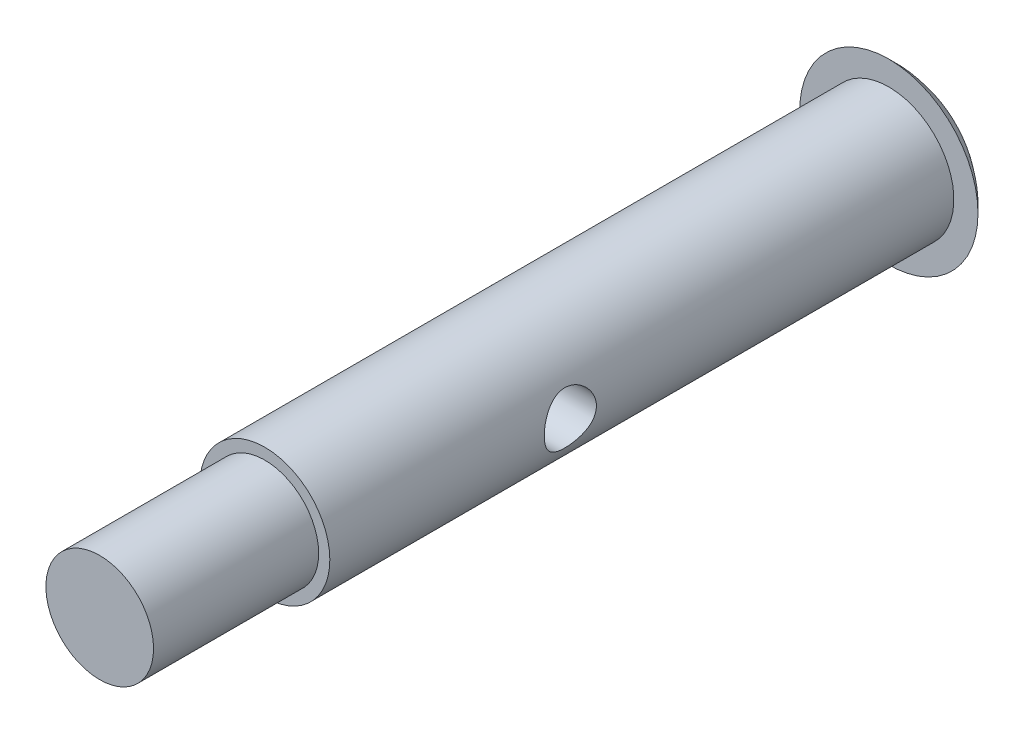
ISO-10303-21;
HEADER;
FILE_DESCRIPTION(('STEP AP214'),'2;1');
FILE_NAME('part.step','',(''),(''),'','','');
FILE_SCHEMA(('AUTOMOTIVE_DESIGN { 1 0 10303 214 1 1 1 1 }'));
ENDSEC;
DATA;
#1=APPLICATION_CONTEXT('core data for automotive mechanical design processes');
#2=APPLICATION_PROTOCOL_DEFINITION('international standard','automotive_design',2000,#1);
#3=PRODUCT_CONTEXT('',#1,'mechanical');
#4=PRODUCT('Part','Part','',(#3));
#5=PRODUCT_RELATED_PRODUCT_CATEGORY('part','',(#4));
#6=PRODUCT_DEFINITION_FORMATION('','',#4);
#7=PRODUCT_DEFINITION_CONTEXT('part definition',#1,'design');
#8=PRODUCT_DEFINITION('design','',#6,#7);
#9=PRODUCT_DEFINITION_SHAPE('','',#8);
#10=(LENGTH_UNIT() NAMED_UNIT(*) SI_UNIT(.MILLI.,.METRE.));
#11=(NAMED_UNIT(*) PLANE_ANGLE_UNIT() SI_UNIT($,.RADIAN.));
#12=(NAMED_UNIT(*) SI_UNIT($,.STERADIAN.) SOLID_ANGLE_UNIT());
#13=UNCERTAINTY_MEASURE_WITH_UNIT(LENGTH_MEASURE(1.E-05),#10,'distance_accuracy_value','');
#14=(GEOMETRIC_REPRESENTATION_CONTEXT(3) GLOBAL_UNCERTAINTY_ASSIGNED_CONTEXT((#13)) GLOBAL_UNIT_ASSIGNED_CONTEXT((#10,
#11,#12)) REPRESENTATION_CONTEXT('',''));
#15=CARTESIAN_POINT('',(0.,0.,0.));
#16=DIRECTION('',(0.,0.,1.));
#17=DIRECTION('',(1.,0.,0.));
#18=AXIS2_PLACEMENT_3D('',#15,#16,#17);
#19=CARTESIAN_POINT('',(0.,0.,24.));
#20=DIRECTION('',(0.,0.,1.));
#21=DIRECTION('',(1.,0.,0.));
#22=AXIS2_PLACEMENT_3D('',#19,#20,#21);
#23=PLANE('',#22);
#24=CARTESIAN_POINT('',(0.,0.,24.));
#25=DIRECTION('',(0.,0.,1.));
#26=DIRECTION('',(1.,0.,0.));
#27=AXIS2_PLACEMENT_3D('',#24,#25,#26);
#28=CIRCLE('',#27,2.5);
#29=CARTESIAN_POINT('',(2.5,0.,24.));
#30=VERTEX_POINT('',#29);
#31=EDGE_CURVE('E10',#30,#30,#28,.T.);
#32=ORIENTED_EDGE('',*,*,#31,.T.);
#33=EDGE_LOOP('',(#32));
#34=FACE_BOUND('',#33,.T.);
#35=CARTESIAN_POINT('',(0.,0.,24.));
#36=DIRECTION('',(0.,0.,1.));
#37=DIRECTION('',(1.,0.,0.));
#38=AXIS2_PLACEMENT_3D('',#35,#36,#37);
#39=CIRCLE('',#38,2.0701);
#40=CARTESIAN_POINT('',(2.0701,0.,24.));
#41=VERTEX_POINT('',#40);
#42=EDGE_CURVE('E65',#41,#41,#39,.T.);
#43=ORIENTED_EDGE('',*,*,#42,.F.);
#44=EDGE_LOOP('',(#43));
#45=FACE_BOUND('',#44,.T.);
#46=ADVANCED_FACE('F15',(#34,#45),#23,.T.);
#47=CARTESIAN_POINT('',(0.,0.,24.));
#48=DIRECTION('',(0.,0.,-1.));
#49=DIRECTION('',(-1.,0.,0.));
#50=AXIS2_PLACEMENT_3D('',#47,#48,#49);
#51=CYLINDRICAL_SURFACE('',#50,2.5);
#52=CARTESIAN_POINT('',(-2.5,0.,15.7533));
#53=CARTESIAN_POINT('',(-2.49999628104951,-0.0539097427882275,15.7532949792012));
#54=CARTESIAN_POINT('',(-2.49823581765217,-0.107912394013531,15.7489290355117));
#55=CARTESIAN_POINT('',(-2.49136518096756,-0.214394849025303,15.7316167648749));
#56=CARTESIAN_POINT('',(-2.48624592953921,-0.266870122033667,15.7186471829373));
#57=CARTESIAN_POINT('',(-2.47320926320191,-0.368585796972824,15.6846760625572));
#58=CARTESIAN_POINT('',(-2.46530104093729,-0.417836203471894,15.6637008926397));
#59=CARTESIAN_POINT('',(-2.44746464966727,-0.512074150719381,15.6144189828374));
#60=CARTESIAN_POINT('',(-2.43753717507514,-0.5570631491752,15.5861147624742));
#61=CARTESIAN_POINT('',(-2.4161396715427,-0.643696896749804,15.5215618411078));
#62=CARTESIAN_POINT('',(-2.40462155344263,-0.685113447635268,15.485022938719));
#63=CARTESIAN_POINT('',(-2.3815594823287,-0.761424175769429,15.4056504470582));
#64=CARTESIAN_POINT('',(-2.37001551941334,-0.796315143544528,15.3628137787615));
#65=CARTESIAN_POINT('',(-2.34763261694302,-0.86012636253309,15.2697280887324));
#66=CARTESIAN_POINT('',(-2.33684854561239,-0.888708502052418,15.2192327345376));
#67=CARTESIAN_POINT('',(-2.31796148276158,-0.936871843079347,15.113653792646));
#68=CARTESIAN_POINT('',(-2.30985720993324,-0.956457347950394,15.0585724135093));
#69=CARTESIAN_POINT('',(-2.29776394174479,-0.985147039187567,14.9480074304023));
#70=CARTESIAN_POINT('',(-2.29360420904503,-0.994688274231542,14.8926565932726));
#71=CARTESIAN_POINT('',(-2.28937641402131,-1.00438366186133,14.7809952357809));
#72=CARTESIAN_POINT('',(-2.28930632124731,-1.00454247269238,14.7246852055367));
#73=CARTESIAN_POINT('',(-2.29312016687817,-0.995799559041085,14.6169156974621));
#74=CARTESIAN_POINT('',(-2.29672712562495,-0.987532533416316,14.5653930171119));
#75=CARTESIAN_POINT('',(-2.30702352819665,-0.963231400052981,14.4645392896182));
#76=CARTESIAN_POINT('',(-2.31371351383015,-0.947195927068537,14.4152086293699));
#77=CARTESIAN_POINT('',(-2.32956942361405,-0.907507184326401,14.3189447172293));
#78=CARTESIAN_POINT('',(-2.33878325235222,-0.883704617264272,14.2720812617608));
#79=CARTESIAN_POINT('',(-2.35863567507726,-0.829262229774393,14.1828406825017));
#80=CARTESIAN_POINT('',(-2.36927480577938,-0.798619830812753,14.1404652595517));
#81=CARTESIAN_POINT('',(-2.39178788837714,-0.728563595941052,14.0579316294599));
#82=CARTESIAN_POINT('',(-2.40369348741116,-0.688652578343357,14.0182029362866));
#83=CARTESIAN_POINT('',(-2.42669418904776,-0.602608392373196,13.9458645568425));
#84=CARTESIAN_POINT('',(-2.43778912780157,-0.556473971474491,13.9132563071054));
#85=CARTESIAN_POINT('',(-2.45819968389749,-0.458067499030601,13.8555157015888));
#86=CARTESIAN_POINT('',(-2.46747526359699,-0.405691123082491,13.8305459592751));
#87=CARTESIAN_POINT('',(-2.48289893604335,-0.297014570345816,13.7899199833852));
#88=CARTESIAN_POINT('',(-2.48904862816531,-0.240716416953763,13.7742589862496));
#89=CARTESIAN_POINT('',(-2.49723555763316,-0.129393787556474,13.7535660828098));
#90=CARTESIAN_POINT('',(-2.49949577809345,-0.0744929392271474,13.7479570247943));
#91=CARTESIAN_POINT('',(-2.50035222804202,0.0355068262849876,13.7458217401479));
#92=CARTESIAN_POINT('',(-2.49894941501782,0.0906056879489813,13.7492931399588));
#93=CARTESIAN_POINT('',(-2.49278327208613,0.196814621699118,13.7647967193406));
#94=CARTESIAN_POINT('',(-2.48817502534748,0.247992325877097,13.776434040532));
#95=CARTESIAN_POINT('',(-2.47622272360687,0.347620795985951,13.8074008910625));
#96=CARTESIAN_POINT('',(-2.46887831756669,0.396071211098125,13.8267314074292));
#97=CARTESIAN_POINT('',(-2.4518860885894,0.490540239218867,13.8731668545646));
#98=CARTESIAN_POINT('',(-2.44217459348303,0.536438883852675,13.900491811847));
#99=CARTESIAN_POINT('',(-2.42149976593282,0.623160929966179,13.9618965633578));
#100=CARTESIAN_POINT('',(-2.41053593073964,0.663982279341924,13.9959790744608));
#101=CARTESIAN_POINT('',(-2.38764644643122,0.742237070409305,14.0725870264516));
#102=CARTESIAN_POINT('',(-2.37570529659268,0.779265137030025,14.1155230042046));
#103=CARTESIAN_POINT('',(-2.35287977791935,0.845691230107603,14.207208816933));
#104=CARTESIAN_POINT('',(-2.34199558824686,0.875087964407254,14.2559596344553));
#105=CARTESIAN_POINT('',(-2.32249555294035,0.925612604906662,14.358647061842));
#106=CARTESIAN_POINT('',(-2.31390353467511,0.946654685397854,14.412630748535));
#107=CARTESIAN_POINT('',(-2.30032870819118,0.979185598688397,14.523824427843));
#108=CARTESIAN_POINT('',(-2.29534321251963,0.990681545874813,14.5810319838083));
#109=CARTESIAN_POINT('',(-2.28993616704495,1.00311217607968,14.6925884985426));
#110=CARTESIAN_POINT('',(-2.28921045219729,1.00475093028198,14.7468447375902));
#111=CARTESIAN_POINT('',(-2.29160742160084,0.999271925647455,14.8548211524136));
#112=CARTESIAN_POINT('',(-2.29472960986387,0.99215529536504,14.9085413963786));
#113=CARTESIAN_POINT('',(-2.3042015184019,0.969943852942007,15.011714376467));
#114=CARTESIAN_POINT('',(-2.31041689742627,0.955180155606525,15.0612518581314));
#115=CARTESIAN_POINT('',(-2.32527943287181,0.918404519000013,15.1571658671664));
#116=CARTESIAN_POINT('',(-2.33392726175187,0.896390575086091,15.2035415160267));
#117=CARTESIAN_POINT('',(-2.35329766000101,0.844277306874986,15.2947207417418));
#118=CARTESIAN_POINT('',(-2.36411092958351,0.813785884983669,15.3392806299976));
#119=CARTESIAN_POINT('',(-2.38631916476345,0.746154472210272,15.4228721511842));
#120=CARTESIAN_POINT('',(-2.39771430703981,0.709012453266763,15.4619020912674));
#121=CARTESIAN_POINT('',(-2.42069879670935,0.62624115844535,15.5359475597744));
#122=CARTESIAN_POINT('',(-2.43225204510906,0.580215507247116,15.5705331781888));
#123=CARTESIAN_POINT('',(-2.45348977696097,0.482576497203705,15.6314999335347));
#124=CARTESIAN_POINT('',(-2.46317339237741,0.430960560169487,15.6578772629707));
#125=CARTESIAN_POINT('',(-2.47941874617755,0.324541862302532,15.7010634894601));
#126=CARTESIAN_POINT('',(-2.48603487755396,0.269815635657636,15.7180402271402));
#127=CARTESIAN_POINT('',(-2.49562294345695,0.158069262114488,15.7424082359556));
#128=CARTESIAN_POINT('',(-2.49860642926079,0.10105698503692,15.7498298951747));
#129=CARTESIAN_POINT('',(-2.49987242092703,0.0292780810937425,15.7529810115763));
#130=CARTESIAN_POINT('',(-2.50000101010706,0.0146424675869373,15.7533013637031));
#131=CARTESIAN_POINT('',(-2.5,0.,15.7533));
#132=B_SPLINE_CURVE_WITH_KNOTS('',3,(#52,#53,#54,#55,#56,#57,#58,#59,#60,#61,#62,#63,#64,#65,
#66,#67,#68,#69,#70,#71,#72,#73,#74,#75,#76,#77,#78,#79,#80,#81,#82,#83,#84,#85,#86,#87,#88,#89,
#90,#91,#92,#93,#94,#95,#96,#97,#98,#99,#100,#101,#102,#103,#104,#105,#106,#107,#108,#109,#110,
#111,#112,#113,#114,#115,#116,#117,#118,#119,#120,#121,#122,#123,#124,#125,#126,#127,#128,#129,
#130,#131),.UNSPECIFIED.,.T.,.F.,(4,2,2,2,2,2,2,2,2,2,2,2,2,2,2,2,2,2,2,2,2,2,2,2,2,2,2,2,2,2,2,
2,2,2,2,2,2,2,2,4),(0.,0.161689908757308,0.323818643717119,0.485417909939326,0.646961696459005,
0.815478954848236,0.984078878268345,1.16024312200603,1.33632301306684,1.50437718715433,
1.6723479239426,1.82853767273864,1.98475488066499,2.14417165470022,2.30364862873671,
2.47554237362416,2.64747076571873,2.8228387494736,2.99811691482466,3.16296273675942,
3.32776547363461,3.48510391976393,3.64246255873767,3.80464185765992,3.96688649347705,
4.13991224397698,4.31296727256993,4.48775671514175,4.66241577627076,4.82443551565706,
4.98643437315801,5.14194188789472,5.29749243552784,5.46198635051499,5.62653051267121,
5.80184362337627,5.97723793398787,6.14939046527198,6.32099413510881,6.36491085824018),.UNSPECIFIED.);
#133=CARTESIAN_POINT('',(-2.5,0.,15.7533));
#134=VERTEX_POINT('',#133);
#135=EDGE_CURVE('E20',#134,#134,#132,.T.);
#136=ORIENTED_EDGE('',*,*,#135,.T.);
#137=EDGE_LOOP('',(#136));
#138=FACE_BOUND('',#137,.T.);
#139=CARTESIAN_POINT('',(2.5,0.,13.7467));
#140=CARTESIAN_POINT('',(2.4999962810495,-0.053909742788226,13.7467050207988));
#141=CARTESIAN_POINT('',(2.49823581765217,-0.107912394013527,13.7510709644884));
#142=CARTESIAN_POINT('',(2.49136518096756,-0.214394849025301,13.7683832351251));
#143=CARTESIAN_POINT('',(2.48624592953921,-0.266870122033669,13.7813528170627));
#144=CARTESIAN_POINT('',(2.47320926320191,-0.368585796972824,13.8153239374428));
#145=CARTESIAN_POINT('',(2.46530104093729,-0.417836203471886,13.8362991073603));
#146=CARTESIAN_POINT('',(2.44746464966727,-0.512074150719373,13.8855810171626));
#147=CARTESIAN_POINT('',(2.43753717507514,-0.557063149175198,13.9138852375258));
#148=CARTESIAN_POINT('',(2.4161396715427,-0.643696896749807,13.9784381588922));
#149=CARTESIAN_POINT('',(2.40462155344263,-0.685113447635269,14.014977061281));
#150=CARTESIAN_POINT('',(2.3815594823287,-0.761424175769429,14.0943495529418));
#151=CARTESIAN_POINT('',(2.37001551941334,-0.796315143544527,14.1371862212385));
#152=CARTESIAN_POINT('',(2.34763261694303,-0.860126362533087,14.2302719112676));
#153=CARTESIAN_POINT('',(2.3368485456124,-0.888708502052413,14.2807672654624));
#154=CARTESIAN_POINT('',(2.31796148276158,-0.936871843079344,14.3863462073539));
#155=CARTESIAN_POINT('',(2.30985720993324,-0.956457347950394,14.4414275864907));
#156=CARTESIAN_POINT('',(2.29776394174479,-0.985147039187569,14.5519925695977));
#157=CARTESIAN_POINT('',(2.29360420904503,-0.994688274231541,14.6073434067274));
#158=CARTESIAN_POINT('',(2.28937641402131,-1.00438366186133,14.719004764219));
#159=CARTESIAN_POINT('',(2.28930632124731,-1.00454247269238,14.7753147944633));
#160=CARTESIAN_POINT('',(2.29312016687817,-0.995799559041086,14.8830843025379));
#161=CARTESIAN_POINT('',(2.29672712562495,-0.987532533416317,14.9346069828881));
#162=CARTESIAN_POINT('',(2.30702352819665,-0.963231400052981,15.0354607103818));
#163=CARTESIAN_POINT('',(2.31371351383015,-0.947195927068535,15.0847913706301));
#164=CARTESIAN_POINT('',(2.32956942361405,-0.907507184326404,15.1810552827707));
#165=CARTESIAN_POINT('',(2.33878325235221,-0.883704617264281,15.2279187382392));
#166=CARTESIAN_POINT('',(2.35863567507726,-0.829262229774401,15.3171593174983));
#167=CARTESIAN_POINT('',(2.36927480577938,-0.798619830812752,15.3595347404483));
#168=CARTESIAN_POINT('',(2.39178788837714,-0.728563595941047,15.4420683705401));
#169=CARTESIAN_POINT('',(2.40369348741116,-0.688652578343357,15.4817970637134));
#170=CARTESIAN_POINT('',(2.42669418904776,-0.602608392373202,15.5541354431575));
#171=CARTESIAN_POINT('',(2.43778912780157,-0.556473971474497,15.5867436928947));
#172=CARTESIAN_POINT('',(2.45819968389749,-0.458067499030602,15.6444842984112));
#173=CARTESIAN_POINT('',(2.467475263597,-0.405691123082486,15.6694540407249));
#174=CARTESIAN_POINT('',(2.48289893604335,-0.29701457034581,15.7100800166148));
#175=CARTESIAN_POINT('',(2.48904862816531,-0.240716416953763,15.7257410137504));
#176=CARTESIAN_POINT('',(2.49723555763316,-0.129393787556476,15.7464339171902));
#177=CARTESIAN_POINT('',(2.49949577809345,-0.0744929392271473,15.7520429752057));
#178=CARTESIAN_POINT('',(2.50035222804202,0.0355068262849893,15.7541782598521));
#179=CARTESIAN_POINT('',(2.49894941501782,0.0906056879489823,15.7507068600412));
#180=CARTESIAN_POINT('',(2.49278327208613,0.196814621699119,15.7352032806594));
#181=CARTESIAN_POINT('',(2.48817502534748,0.247992325877098,15.723565959468));
#182=CARTESIAN_POINT('',(2.47622272360687,0.347620795985952,15.6925991089375));
#183=CARTESIAN_POINT('',(2.46887831756669,0.396071211098125,15.6732685925708));
#184=CARTESIAN_POINT('',(2.4518860885894,0.490540239218869,15.6268331454354));
#185=CARTESIAN_POINT('',(2.44217459348303,0.536438883852678,15.599508188153));
#186=CARTESIAN_POINT('',(2.42149976593282,0.623160929966181,15.5381034366422));
#187=CARTESIAN_POINT('',(2.41053593073964,0.663982279341924,15.5040209255392));
#188=CARTESIAN_POINT('',(2.38764644643122,0.742237070409308,15.4274129735484));
#189=CARTESIAN_POINT('',(2.37570529659268,0.779265137030032,15.3844769957954));
#190=CARTESIAN_POINT('',(2.35287977791935,0.845691230107609,15.292791183067));
#191=CARTESIAN_POINT('',(2.34199558824686,0.875087964407253,15.2440403655446));
#192=CARTESIAN_POINT('',(2.32249555294035,0.925612604906659,15.141352938158));
#193=CARTESIAN_POINT('',(2.31390353467511,0.946654685397855,15.087369251465));
#194=CARTESIAN_POINT('',(2.30032870819118,0.9791855986884,14.976175572157));
#195=CARTESIAN_POINT('',(2.29534321251963,0.990681545874814,14.9189680161917));
#196=CARTESIAN_POINT('',(2.28993616704495,1.00311217607968,14.8074115014574));
#197=CARTESIAN_POINT('',(2.28921045219729,1.00475093028198,14.7531552624098));
#198=CARTESIAN_POINT('',(2.29160742160084,0.999271925647455,14.6451788475864));
#199=CARTESIAN_POINT('',(2.29472960986387,0.99215529536504,14.5914586036214));
#200=CARTESIAN_POINT('',(2.3042015184019,0.969943852942007,14.488285623533));
#201=CARTESIAN_POINT('',(2.31041689742627,0.955180155606525,14.4387481418686));
#202=CARTESIAN_POINT('',(2.32527943287181,0.918404519000013,14.3428341328336));
#203=CARTESIAN_POINT('',(2.33392726175187,0.896390575086091,14.2964584839733));
#204=CARTESIAN_POINT('',(2.35329766000101,0.844277306874985,14.2052792582582));
#205=CARTESIAN_POINT('',(2.36411092958351,0.813785884983666,14.1607193700024));
#206=CARTESIAN_POINT('',(2.38631916476345,0.746154472210271,14.0771278488158));
#207=CARTESIAN_POINT('',(2.39771430703981,0.709012453266765,14.0380979087325));
#208=CARTESIAN_POINT('',(2.42069879670935,0.626241158445351,13.9640524402256));
#209=CARTESIAN_POINT('',(2.43225204510906,0.580215507247112,13.9294668218112));
#210=CARTESIAN_POINT('',(2.45348977696098,0.482576497203697,13.8685000664653));
#211=CARTESIAN_POINT('',(2.46317339237741,0.430960560169483,13.8421227370293));
#212=CARTESIAN_POINT('',(2.47941874617755,0.324541862302531,13.7989365105399));
#213=CARTESIAN_POINT('',(2.48603487755396,0.269815635657636,13.7819597728598));
#214=CARTESIAN_POINT('',(2.49562294345695,0.158069262114489,13.7575917640444));
#215=CARTESIAN_POINT('',(2.4986064292608,0.101056985036921,13.7501701048253));
#216=CARTESIAN_POINT('',(2.49987242092704,0.0292780810937434,13.7470189884238));
#217=CARTESIAN_POINT('',(2.50000101010707,0.0146424675869377,13.7466986362969));
#218=CARTESIAN_POINT('',(2.5,0.,13.7467));
#219=B_SPLINE_CURVE_WITH_KNOTS('',3,(#139,#140,#141,#142,#143,#144,#145,#146,#147,#148,#149,
#150,#151,#152,#153,#154,#155,#156,#157,#158,#159,#160,#161,#162,#163,#164,#165,#166,#167,#168,
#169,#170,#171,#172,#173,#174,#175,#176,#177,#178,#179,#180,#181,#182,#183,#184,#185,#186,#187,
#188,#189,#190,#191,#192,#193,#194,#195,#196,#197,#198,#199,#200,#201,#202,#203,#204,#205,#206,
#207,#208,#209,#210,#211,#212,#213,#214,#215,#216,#217,#218),.UNSPECIFIED.,.T.,.F.,(4,2,2,2,2,2,
2,2,2,2,2,2,2,2,2,2,2,2,2,2,2,2,2,2,2,2,2,2,2,2,2,2,2,2,2,2,2,2,2,4),(0.,0.161689908757305,
0.323818643717112,0.485417909939322,0.646961696459005,0.815478954848243,0.984078878268358,
1.16024312200603,1.33632301306681,1.50437718715432,1.67234792394261,1.82853767273865,
1.98475488066499,2.14417165470021,2.3036486287367,2.47554237362416,2.64747076571874,
2.82283874947361,2.99811691482467,3.16296273675943,3.32776547363462,3.48510391976394,
3.64246255873768,3.80464185765993,3.96688649347706,4.139912243977,4.31296727256995,
4.48775671514176,4.66241577627077,4.82443551565706,4.98643437315802,5.14194188789473,
5.29749243552784,5.461986350515,5.62653051267122,5.80184362337629,5.97723793398788,
6.14939046527199,6.32099413510882,6.36491085824019),.UNSPECIFIED.);
#220=CARTESIAN_POINT('',(2.5,0.,13.7467));
#221=VERTEX_POINT('',#220);
#222=EDGE_CURVE('E35',#221,#221,#219,.T.);
#223=ORIENTED_EDGE('',*,*,#222,.T.);
#224=EDGE_LOOP('',(#223));
#225=FACE_BOUND('',#224,.T.);
#226=ORIENTED_EDGE('',*,*,#31,.F.);
#227=EDGE_LOOP('',(#226));
#228=FACE_BOUND('',#227,.T.);
#229=CARTESIAN_POINT('',(0.,0.,0.));
#230=DIRECTION('',(0.,0.,-1.));
#231=DIRECTION('',(-1.,0.,0.));
#232=AXIS2_PLACEMENT_3D('',#229,#230,#231);
#233=CIRCLE('',#232,2.5);
#234=CARTESIAN_POINT('',(-2.5,0.,0.));
#235=VERTEX_POINT('',#234);
#236=EDGE_CURVE('E27',#235,#235,#233,.T.);
#237=ORIENTED_EDGE('',*,*,#236,.F.);
#238=EDGE_LOOP('',(#237));
#239=FACE_BOUND('',#238,.T.);
#240=ADVANCED_FACE('F17',(#138,#225,#228,#239),#51,.T.);
#241=CARTESIAN_POINT('',(0.,3.429,0.));
#242=DIRECTION('',(0.,0.,-1.));
#243=DIRECTION('',(-1.,0.,0.));
#244=AXIS2_PLACEMENT_3D('',#241,#242,#243);
#245=PLANE('',#244);
#246=CARTESIAN_POINT('',(0.,0.,0.));
#247=DIRECTION('',(0.,0.,1.));
#248=DIRECTION('',(1.,0.,0.));
#249=AXIS2_PLACEMENT_3D('',#246,#247,#248);
#250=CIRCLE('',#249,3.429);
#251=CARTESIAN_POINT('',(3.429,0.,0.));
#252=VERTEX_POINT('',#251);
#253=EDGE_CURVE('E32',#252,#252,#250,.T.);
#254=ORIENTED_EDGE('',*,*,#253,.T.);
#255=EDGE_LOOP('',(#254));
#256=FACE_BOUND('',#255,.T.);
#257=ORIENTED_EDGE('',*,*,#236,.T.);
#258=EDGE_LOOP('',(#257));
#259=FACE_BOUND('',#258,.T.);
#260=ADVANCED_FACE('F52',(#256,#259),#245,.F.);
#261=CARTESIAN_POINT('',(0.,0.,3.095625));
#262=DIRECTION('',(0.,0.,1.));
#263=DIRECTION('',(0.,1.,0.));
#264=AXIS2_PLACEMENT_3D('',#261,#262,#263);
#265=SPHERICAL_SURFACE('',#264,4.619625);
#266=ORIENTED_EDGE('',*,*,#253,.F.);
#267=EDGE_LOOP('',(#266));
#268=FACE_BOUND('',#267,.T.);
#269=ADVANCED_FACE('F46',(#268),#265,.T.);
#270=CARTESIAN_POINT('',(-3.429,0.,14.75));
#271=DIRECTION('',(1.,0.,0.));
#272=DIRECTION('',(0.,0.,-1.));
#273=AXIS2_PLACEMENT_3D('',#270,#271,#272);
#274=CYLINDRICAL_SURFACE('',#273,1.0033);
#275=ORIENTED_EDGE('',*,*,#222,.F.);
#276=EDGE_LOOP('',(#275));
#277=FACE_BOUND('',#276,.T.);
#278=ORIENTED_EDGE('',*,*,#135,.F.);
#279=EDGE_LOOP('',(#278));
#280=FACE_BOUND('',#279,.T.);
#281=ADVANCED_FACE('F40',(#277,#280),#274,.F.);
#282=CARTESIAN_POINT('',(0.,0.,30.35));
#283=DIRECTION('',(0.,0.,-1.));
#284=DIRECTION('',(-1.,0.,0.));
#285=AXIS2_PLACEMENT_3D('',#282,#283,#284);
#286=CYLINDRICAL_SURFACE('',#285,2.0701);
#287=CARTESIAN_POINT('',(0.,0.,30.35));
#288=DIRECTION('',(0.,0.,1.));
#289=DIRECTION('',(1.,0.,0.));
#290=AXIS2_PLACEMENT_3D('',#287,#288,#289);
#291=CIRCLE('',#290,2.0701);
#292=CARTESIAN_POINT('',(2.0701,0.,30.35));
#293=VERTEX_POINT('',#292);
#294=EDGE_CURVE('E39',#293,#293,#291,.T.);
#295=ORIENTED_EDGE('',*,*,#294,.F.);
#296=EDGE_LOOP('',(#295));
#297=FACE_BOUND('',#296,.T.);
#298=ORIENTED_EDGE('',*,*,#42,.T.);
#299=EDGE_LOOP('',(#298));
#300=FACE_BOUND('',#299,.T.);
#301=ADVANCED_FACE('F45',(#297,#300),#286,.T.);
#302=CARTESIAN_POINT('',(0.,0.,30.35));
#303=DIRECTION('',(0.,0.,1.));
#304=DIRECTION('',(1.,0.,0.));
#305=AXIS2_PLACEMENT_3D('',#302,#303,#304);
#306=PLANE('',#305);
#307=ORIENTED_EDGE('',*,*,#294,.T.);
#308=EDGE_LOOP('',(#307));
#309=FACE_BOUND('',#308,.T.);
#310=ADVANCED_FACE('F83',(#309),#306,.T.);
#311=CLOSED_SHELL('',(#46,#240,#260,#269,#281,#301,#310));
#312=MANIFOLD_SOLID_BREP('B1',#311);
#313=ADVANCED_BREP_SHAPE_REPRESENTATION('',(#18,#312),#14);
#314=SHAPE_DEFINITION_REPRESENTATION(#9,#313);
ENDSEC;
END-ISO-10303-21;
